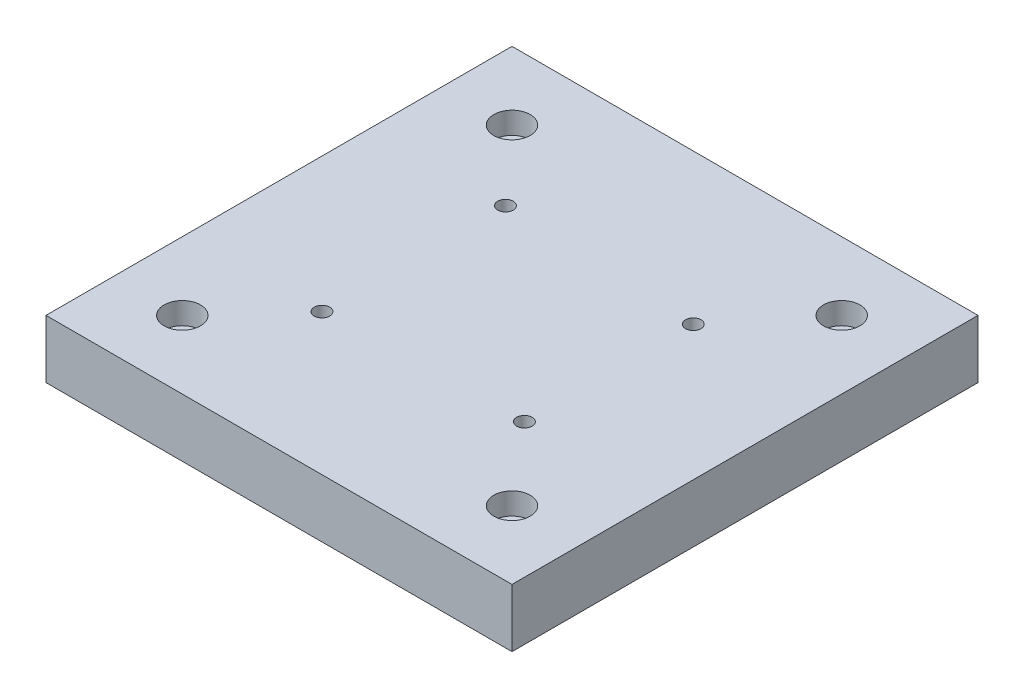
ISO-10303-21;
HEADER;
FILE_DESCRIPTION(('STEP AP214'),'2;1');
FILE_NAME('part.step','',(''),(''),'','','');
FILE_SCHEMA(('AUTOMOTIVE_DESIGN { 1 0 10303 214 1 1 1 1 }'));
ENDSEC;
DATA;
#1=APPLICATION_CONTEXT('core data for automotive mechanical design processes');
#2=APPLICATION_PROTOCOL_DEFINITION('international standard','automotive_design',2000,#1);
#3=PRODUCT_CONTEXT('',#1,'mechanical');
#4=PRODUCT('Part','Part','',(#3));
#5=PRODUCT_RELATED_PRODUCT_CATEGORY('part','',(#4));
#6=PRODUCT_DEFINITION_FORMATION('','',#4);
#7=PRODUCT_DEFINITION_CONTEXT('part definition',#1,'design');
#8=PRODUCT_DEFINITION('design','',#6,#7);
#9=PRODUCT_DEFINITION_SHAPE('','',#8);
#10=(LENGTH_UNIT() NAMED_UNIT(*) SI_UNIT(.MILLI.,.METRE.));
#11=(NAMED_UNIT(*) PLANE_ANGLE_UNIT() SI_UNIT($,.RADIAN.));
#12=(NAMED_UNIT(*) SI_UNIT($,.STERADIAN.) SOLID_ANGLE_UNIT());
#13=UNCERTAINTY_MEASURE_WITH_UNIT(LENGTH_MEASURE(1.E-05),#10,'distance_accuracy_value','');
#14=(GEOMETRIC_REPRESENTATION_CONTEXT(3) GLOBAL_UNCERTAINTY_ASSIGNED_CONTEXT((#13)) GLOBAL_UNIT_ASSIGNED_CONTEXT((#10,
#11,#12)) REPRESENTATION_CONTEXT('',''));
#15=CARTESIAN_POINT('',(0.,0.,0.));
#16=DIRECTION('',(0.,0.,1.));
#17=DIRECTION('',(1.,0.,0.));
#18=AXIS2_PLACEMENT_3D('',#15,#16,#17);
#19=CARTESIAN_POINT('',(0.,25.4,0.));
#20=DIRECTION('',(1.,0.,0.));
#21=DIRECTION('',(0.,0.,-1.));
#22=AXIS2_PLACEMENT_3D('',#19,#20,#21);
#23=PLANE('',#22);
#24=DIRECTION('',(0.,0.,1.));
#25=VECTOR('',#24,1.);
#26=CARTESIAN_POINT('',(0.,0.,0.));
#27=LINE('',#26,#25);
#28=CARTESIAN_POINT('',(0.,0.,-203.2));
#29=VERTEX_POINT('',#28);
#30=CARTESIAN_POINT('',(0.,0.,0.));
#31=VERTEX_POINT('',#30);
#32=EDGE_CURVE('E109',#29,#31,#27,.T.);
#33=ORIENTED_EDGE('',*,*,#32,.T.);
#34=DIRECTION('',(0.,-1.,0.));
#35=VECTOR('',#34,1.);
#36=CARTESIAN_POINT('',(0.,25.4,0.));
#37=LINE('',#36,#35);
#38=CARTESIAN_POINT('',(0.,25.4,0.));
#39=VERTEX_POINT('',#38);
#40=EDGE_CURVE('E11',#39,#31,#37,.T.);
#41=ORIENTED_EDGE('',*,*,#40,.F.);
#42=DIRECTION('',(0.,0.,1.));
#43=VECTOR('',#42,1.);
#44=CARTESIAN_POINT('',(0.,25.4,0.));
#45=LINE('',#44,#43);
#46=CARTESIAN_POINT('',(0.,25.4,-203.2));
#47=VERTEX_POINT('',#46);
#48=EDGE_CURVE('E93',#47,#39,#45,.T.);
#49=ORIENTED_EDGE('',*,*,#48,.F.);
#50=DIRECTION('',(0.,-1.,0.));
#51=VECTOR('',#50,1.);
#52=CARTESIAN_POINT('',(0.,25.4,-203.2));
#53=LINE('',#52,#51);
#54=EDGE_CURVE('E105',#47,#29,#53,.T.);
#55=ORIENTED_EDGE('',*,*,#54,.T.);
#56=EDGE_LOOP('',(#33,#41,#49,#55));
#57=FACE_BOUND('',#56,.T.);
#58=ADVANCED_FACE('F41',(#57),#23,.F.);
#59=CARTESIAN_POINT('',(0.,25.4,0.));
#60=DIRECTION('',(0.,0.,-1.));
#61=DIRECTION('',(-1.,0.,0.));
#62=AXIS2_PLACEMENT_3D('',#59,#60,#61);
#63=PLANE('',#62);
#64=DIRECTION('',(1.,0.,0.));
#65=VECTOR('',#64,1.);
#66=CARTESIAN_POINT('',(0.,0.,0.));
#67=LINE('',#66,#65);
#68=CARTESIAN_POINT('',(203.2,0.,0.));
#69=VERTEX_POINT('',#68);
#70=EDGE_CURVE('E98',#31,#69,#67,.T.);
#71=ORIENTED_EDGE('',*,*,#70,.T.);
#72=DIRECTION('',(0.,-1.,0.));
#73=VECTOR('',#72,1.);
#74=CARTESIAN_POINT('',(203.2,25.4,0.));
#75=LINE('',#74,#73);
#76=CARTESIAN_POINT('',(203.2,25.4,0.));
#77=VERTEX_POINT('',#76);
#78=EDGE_CURVE('E50',#77,#69,#75,.T.);
#79=ORIENTED_EDGE('',*,*,#78,.F.);
#80=DIRECTION('',(1.,0.,0.));
#81=VECTOR('',#80,1.);
#82=CARTESIAN_POINT('',(0.,25.4,0.));
#83=LINE('',#82,#81);
#84=EDGE_CURVE('E88',#39,#77,#83,.T.);
#85=ORIENTED_EDGE('',*,*,#84,.F.);
#86=ORIENTED_EDGE('',*,*,#40,.T.);
#87=EDGE_LOOP('',(#71,#79,#85,#86));
#88=FACE_BOUND('',#87,.T.);
#89=ADVANCED_FACE('F97',(#88),#63,.F.);
#90=CARTESIAN_POINT('',(203.2,25.4,0.));
#91=DIRECTION('',(-1.,0.,0.));
#92=DIRECTION('',(0.,0.,1.));
#93=AXIS2_PLACEMENT_3D('',#90,#91,#92);
#94=PLANE('',#93);
#95=DIRECTION('',(0.,0.,-1.));
#96=VECTOR('',#95,1.);
#97=CARTESIAN_POINT('',(203.2,0.,0.));
#98=LINE('',#97,#96);
#99=CARTESIAN_POINT('',(203.2,0.,-203.2));
#100=VERTEX_POINT('',#99);
#101=EDGE_CURVE('E75',#69,#100,#98,.T.);
#102=ORIENTED_EDGE('',*,*,#101,.T.);
#103=DIRECTION('',(0.,-1.,0.));
#104=VECTOR('',#103,1.);
#105=CARTESIAN_POINT('',(203.2,25.4,-203.2));
#106=LINE('',#105,#104);
#107=CARTESIAN_POINT('',(203.2,25.4,-203.2));
#108=VERTEX_POINT('',#107);
#109=EDGE_CURVE('E100',#108,#100,#106,.T.);
#110=ORIENTED_EDGE('',*,*,#109,.F.);
#111=DIRECTION('',(0.,0.,-1.));
#112=VECTOR('',#111,1.);
#113=CARTESIAN_POINT('',(203.2,25.4,0.));
#114=LINE('',#113,#112);
#115=EDGE_CURVE('E91',#77,#108,#114,.T.);
#116=ORIENTED_EDGE('',*,*,#115,.F.);
#117=ORIENTED_EDGE('',*,*,#78,.T.);
#118=EDGE_LOOP('',(#102,#110,#116,#117));
#119=FACE_BOUND('',#118,.T.);
#120=ADVANCED_FACE('F101',(#119),#94,.F.);
#121=CARTESIAN_POINT('',(0.,25.4,-203.2));
#122=DIRECTION('',(0.,0.,1.));
#123=DIRECTION('',(1.,0.,0.));
#124=AXIS2_PLACEMENT_3D('',#121,#122,#123);
#125=PLANE('',#124);
#126=DIRECTION('',(-1.,0.,0.));
#127=VECTOR('',#126,1.);
#128=CARTESIAN_POINT('',(0.,0.,-203.2));
#129=LINE('',#128,#127);
#130=EDGE_CURVE('E81',#100,#29,#129,.T.);
#131=ORIENTED_EDGE('',*,*,#130,.T.);
#132=ORIENTED_EDGE('',*,*,#54,.F.);
#133=DIRECTION('',(-1.,0.,0.));
#134=VECTOR('',#133,1.);
#135=CARTESIAN_POINT('',(0.,25.4,-203.2));
#136=LINE('',#135,#134);
#137=EDGE_CURVE('E58',#108,#47,#136,.T.);
#138=ORIENTED_EDGE('',*,*,#137,.F.);
#139=ORIENTED_EDGE('',*,*,#109,.T.);
#140=EDGE_LOOP('',(#131,#132,#138,#139));
#141=FACE_BOUND('',#140,.T.);
#142=ADVANCED_FACE('F123',(#141),#125,.F.);
#143=CARTESIAN_POINT('',(0.,25.4,0.));
#144=DIRECTION('',(0.,-1.,0.));
#145=DIRECTION('',(0.,0.,-1.));
#146=AXIS2_PLACEMENT_3D('',#143,#144,#145);
#147=PLANE('',#146);
#148=CARTESIAN_POINT('',(29.718,25.4,-173.482));
#149=DIRECTION('',(0.,1.,0.));
#150=DIRECTION('',(0.,0.,1.));
#151=AXIS2_PLACEMENT_3D('',#148,#149,#150);
#152=CIRCLE('',#151,7.9375);
#153=CARTESIAN_POINT('',(29.718,25.4,-165.5445));
#154=VERTEX_POINT('',#153);
#155=EDGE_CURVE('E253',#154,#154,#152,.T.);
#156=ORIENTED_EDGE('',*,*,#155,.F.);
#157=EDGE_LOOP('',(#156));
#158=FACE_BOUND('',#157,.T.);
#159=CARTESIAN_POINT('',(29.718,25.4,-29.718));
#160=DIRECTION('',(0.,1.,0.));
#161=DIRECTION('',(0.,0.,1.));
#162=AXIS2_PLACEMENT_3D('',#159,#160,#161);
#163=CIRCLE('',#162,7.9375);
#164=CARTESIAN_POINT('',(29.718,25.4,-21.7805));
#165=VERTEX_POINT('',#164);
#166=EDGE_CURVE('E237',#165,#165,#163,.T.);
#167=ORIENTED_EDGE('',*,*,#166,.F.);
#168=EDGE_LOOP('',(#167));
#169=FACE_BOUND('',#168,.T.);
#170=CARTESIAN_POINT('',(173.482,25.4,-29.718));
#171=DIRECTION('',(0.,1.,0.));
#172=DIRECTION('',(0.,0.,1.));
#173=AXIS2_PLACEMENT_3D('',#170,#171,#172);
#174=CIRCLE('',#173,7.93749999999999);
#175=CARTESIAN_POINT('',(173.482,25.4,-21.7805));
#176=VERTEX_POINT('',#175);
#177=EDGE_CURVE('E221',#176,#176,#174,.T.);
#178=ORIENTED_EDGE('',*,*,#177,.F.);
#179=EDGE_LOOP('',(#178));
#180=FACE_BOUND('',#179,.T.);
#181=CARTESIAN_POINT('',(173.482,25.4,-173.482));
#182=DIRECTION('',(0.,1.,0.));
#183=DIRECTION('',(0.,0.,1.));
#184=AXIS2_PLACEMENT_3D('',#181,#182,#183);
#185=CIRCLE('',#184,7.93749999999999);
#186=CARTESIAN_POINT('',(173.482,25.4,-165.5445));
#187=VERTEX_POINT('',#186);
#188=EDGE_CURVE('E205',#187,#187,#185,.T.);
#189=ORIENTED_EDGE('',*,*,#188,.F.);
#190=EDGE_LOOP('',(#189));
#191=FACE_BOUND('',#190,.T.);
#192=CARTESIAN_POINT('',(144.4625,25.4,-64.135));
#193=DIRECTION('',(0.,-1.,0.));
#194=DIRECTION('',(0.,0.,-1.));
#195=AXIS2_PLACEMENT_3D('',#192,#193,#194);
#196=CIRCLE('',#195,3.3782);
#197=CARTESIAN_POINT('',(144.4625,25.4,-67.5132));
#198=VERTEX_POINT('',#197);
#199=EDGE_CURVE('E177',#198,#198,#196,.T.);
#200=ORIENTED_EDGE('',*,*,#199,.T.);
#201=EDGE_LOOP('',(#200));
#202=FACE_BOUND('',#201,.T.);
#203=CARTESIAN_POINT('',(58.7375,25.4,-61.595));
#204=DIRECTION('',(0.,-1.,0.));
#205=DIRECTION('',(0.,0.,-1.));
#206=AXIS2_PLACEMENT_3D('',#203,#204,#205);
#207=CIRCLE('',#206,3.37819999999999);
#208=CARTESIAN_POINT('',(58.7375,25.4,-64.9732));
#209=VERTEX_POINT('',#208);
#210=EDGE_CURVE('E161',#209,#209,#207,.T.);
#211=ORIENTED_EDGE('',*,*,#210,.T.);
#212=EDGE_LOOP('',(#211));
#213=FACE_BOUND('',#212,.T.);
#214=CARTESIAN_POINT('',(58.7375,25.4,-141.605));
#215=DIRECTION('',(0.,-1.,0.));
#216=DIRECTION('',(0.,0.,-1.));
#217=AXIS2_PLACEMENT_3D('',#214,#215,#216);
#218=CIRCLE('',#217,3.37819999999999);
#219=CARTESIAN_POINT('',(58.7375,25.4,-144.9832));
#220=VERTEX_POINT('',#219);
#221=EDGE_CURVE('E145',#220,#220,#218,.T.);
#222=ORIENTED_EDGE('',*,*,#221,.T.);
#223=EDGE_LOOP('',(#222));
#224=FACE_BOUND('',#223,.T.);
#225=CARTESIAN_POINT('',(144.4625,25.4,-137.795));
#226=DIRECTION('',(0.,-1.,0.));
#227=DIRECTION('',(0.,0.,-1.));
#228=AXIS2_PLACEMENT_3D('',#225,#226,#227);
#229=CIRCLE('',#228,3.3782);
#230=CARTESIAN_POINT('',(144.4625,25.4,-141.1732));
#231=VERTEX_POINT('',#230);
#232=EDGE_CURVE('E113',#231,#231,#229,.T.);
#233=ORIENTED_EDGE('',*,*,#232,.T.);
#234=EDGE_LOOP('',(#233));
#235=FACE_BOUND('',#234,.T.);
#236=ORIENTED_EDGE('',*,*,#48,.T.);
#237=ORIENTED_EDGE('',*,*,#84,.T.);
#238=ORIENTED_EDGE('',*,*,#115,.T.);
#239=ORIENTED_EDGE('',*,*,#137,.T.);
#240=EDGE_LOOP('',(#236,#237,#238,#239));
#241=FACE_BOUND('',#240,.T.);
#242=ADVANCED_FACE('F89',(#158,#169,#180,#191,#202,#213,#224,#235,#241),#147,.F.);
#243=CARTESIAN_POINT('',(0.,0.,0.));
#244=DIRECTION('',(0.,-1.,0.));
#245=DIRECTION('',(0.,0.,-1.));
#246=AXIS2_PLACEMENT_3D('',#243,#244,#245);
#247=PLANE('',#246);
#248=CARTESIAN_POINT('',(29.718,0.,-173.482));
#249=DIRECTION('',(0.,1.,0.));
#250=DIRECTION('',(0.,0.,1.));
#251=AXIS2_PLACEMENT_3D('',#248,#249,#250);
#252=CIRCLE('',#251,5.04189999999999);
#253=CARTESIAN_POINT('',(29.718,0.,-168.4401));
#254=VERTEX_POINT('',#253);
#255=EDGE_CURVE('E241',#254,#254,#252,.T.);
#256=ORIENTED_EDGE('',*,*,#255,.T.);
#257=EDGE_LOOP('',(#256));
#258=FACE_BOUND('',#257,.T.);
#259=CARTESIAN_POINT('',(29.718,0.,-29.718));
#260=DIRECTION('',(0.,1.,0.));
#261=DIRECTION('',(0.,0.,1.));
#262=AXIS2_PLACEMENT_3D('',#259,#260,#261);
#263=CIRCLE('',#262,5.04189999999999);
#264=CARTESIAN_POINT('',(29.718,0.,-24.6761));
#265=VERTEX_POINT('',#264);
#266=EDGE_CURVE('E225',#265,#265,#263,.T.);
#267=ORIENTED_EDGE('',*,*,#266,.T.);
#268=EDGE_LOOP('',(#267));
#269=FACE_BOUND('',#268,.T.);
#270=CARTESIAN_POINT('',(173.482,0.,-29.718));
#271=DIRECTION('',(0.,1.,0.));
#272=DIRECTION('',(0.,0.,1.));
#273=AXIS2_PLACEMENT_3D('',#270,#271,#272);
#274=CIRCLE('',#273,5.04189999999999);
#275=CARTESIAN_POINT('',(173.482,0.,-24.6761));
#276=VERTEX_POINT('',#275);
#277=EDGE_CURVE('E209',#276,#276,#274,.T.);
#278=ORIENTED_EDGE('',*,*,#277,.T.);
#279=EDGE_LOOP('',(#278));
#280=FACE_BOUND('',#279,.T.);
#281=CARTESIAN_POINT('',(173.482,0.,-173.482));
#282=DIRECTION('',(0.,1.,0.));
#283=DIRECTION('',(0.,0.,1.));
#284=AXIS2_PLACEMENT_3D('',#281,#282,#283);
#285=CIRCLE('',#284,5.04189999999999);
#286=CARTESIAN_POINT('',(173.482,0.,-168.4401));
#287=VERTEX_POINT('',#286);
#288=EDGE_CURVE('E193',#287,#287,#285,.T.);
#289=ORIENTED_EDGE('',*,*,#288,.T.);
#290=EDGE_LOOP('',(#289));
#291=FACE_BOUND('',#290,.T.);
#292=CARTESIAN_POINT('',(144.4625,0.,-64.135));
#293=DIRECTION('',(0.,-1.,0.));
#294=DIRECTION('',(0.,0.,-1.));
#295=AXIS2_PLACEMENT_3D('',#292,#293,#294);
#296=CIRCLE('',#295,5.55624999999998);
#297=CARTESIAN_POINT('',(144.4625,0.,-69.69125));
#298=VERTEX_POINT('',#297);
#299=EDGE_CURVE('E189',#298,#298,#296,.T.);
#300=ORIENTED_EDGE('',*,*,#299,.F.);
#301=EDGE_LOOP('',(#300));
#302=FACE_BOUND('',#301,.T.);
#303=CARTESIAN_POINT('',(58.7375,0.,-61.595));
#304=DIRECTION('',(0.,-1.,0.));
#305=DIRECTION('',(0.,0.,-1.));
#306=AXIS2_PLACEMENT_3D('',#303,#304,#305);
#307=CIRCLE('',#306,5.55624999999999);
#308=CARTESIAN_POINT('',(58.7375,0.,-67.15125));
#309=VERTEX_POINT('',#308);
#310=EDGE_CURVE('E173',#309,#309,#307,.T.);
#311=ORIENTED_EDGE('',*,*,#310,.F.);
#312=EDGE_LOOP('',(#311));
#313=FACE_BOUND('',#312,.T.);
#314=CARTESIAN_POINT('',(58.7375,0.,-141.605));
#315=DIRECTION('',(0.,-1.,0.));
#316=DIRECTION('',(0.,0.,-1.));
#317=AXIS2_PLACEMENT_3D('',#314,#315,#316);
#318=CIRCLE('',#317,5.55625);
#319=CARTESIAN_POINT('',(58.7375,0.,-147.16125));
#320=VERTEX_POINT('',#319);
#321=EDGE_CURVE('E157',#320,#320,#318,.T.);
#322=ORIENTED_EDGE('',*,*,#321,.F.);
#323=EDGE_LOOP('',(#322));
#324=FACE_BOUND('',#323,.T.);
#325=CARTESIAN_POINT('',(144.4625,0.,-137.795));
#326=DIRECTION('',(0.,-1.,0.));
#327=DIRECTION('',(0.,0.,-1.));
#328=AXIS2_PLACEMENT_3D('',#325,#326,#327);
#329=CIRCLE('',#328,5.55624999999998);
#330=CARTESIAN_POINT('',(144.4625,0.,-143.35125));
#331=VERTEX_POINT('',#330);
#332=EDGE_CURVE('E141',#331,#331,#329,.T.);
#333=ORIENTED_EDGE('',*,*,#332,.F.);
#334=EDGE_LOOP('',(#333));
#335=FACE_BOUND('',#334,.T.);
#336=ORIENTED_EDGE('',*,*,#32,.F.);
#337=ORIENTED_EDGE('',*,*,#130,.F.);
#338=ORIENTED_EDGE('',*,*,#101,.F.);
#339=ORIENTED_EDGE('',*,*,#70,.F.);
#340=EDGE_LOOP('',(#336,#337,#338,#339));
#341=FACE_BOUND('',#340,.T.);
#342=ADVANCED_FACE('F126',(#258,#269,#280,#291,#302,#313,#324,#335,#341),#247,.T.);
#343=CARTESIAN_POINT('',(144.4625,0.,-137.795));
#344=DIRECTION('',(0.,-1.,0.));
#345=DIRECTION('',(0.,0.,-1.));
#346=AXIS2_PLACEMENT_3D('',#343,#344,#345);
#347=CYLINDRICAL_SURFACE('',#346,3.3782);
#348=ORIENTED_EDGE('',*,*,#232,.F.);
#349=EDGE_LOOP('',(#348));
#350=FACE_BOUND('',#349,.T.);
#351=CARTESIAN_POINT('',(144.4625,18.3500014,-137.795));
#352=DIRECTION('',(0.,-1.,0.));
#353=DIRECTION('',(0.,0.,-1.));
#354=AXIS2_PLACEMENT_3D('',#351,#352,#353);
#355=CIRCLE('',#354,3.3782);
#356=CARTESIAN_POINT('',(144.4625,18.3500014,-141.1732));
#357=VERTEX_POINT('',#356);
#358=EDGE_CURVE('E133',#357,#357,#355,.T.);
#359=ORIENTED_EDGE('',*,*,#358,.T.);
#360=EDGE_LOOP('',(#359));
#361=FACE_BOUND('',#360,.T.);
#362=ADVANCED_FACE('F277',(#350,#361),#347,.F.);
#363=CARTESIAN_POINT('',(147.8407,18.3500014,-137.795));
#364=DIRECTION('',(0.,1.,0.));
#365=DIRECTION('',(0.,0.,1.));
#366=AXIS2_PLACEMENT_3D('',#363,#364,#365);
#367=PLANE('',#366);
#368=ORIENTED_EDGE('',*,*,#358,.F.);
#369=EDGE_LOOP('',(#368));
#370=FACE_BOUND('',#369,.T.);
#371=CARTESIAN_POINT('',(144.4625,18.3500014,-137.795));
#372=DIRECTION('',(0.,-1.,0.));
#373=DIRECTION('',(0.,0.,-1.));
#374=AXIS2_PLACEMENT_3D('',#371,#372,#373);
#375=CIRCLE('',#374,5.55624999999998);
#376=CARTESIAN_POINT('',(144.4625,18.3500014,-143.35125));
#377=VERTEX_POINT('',#376);
#378=EDGE_CURVE('E137',#377,#377,#375,.T.);
#379=ORIENTED_EDGE('',*,*,#378,.T.);
#380=EDGE_LOOP('',(#379));
#381=FACE_BOUND('',#380,.T.);
#382=ADVANCED_FACE('F280',(#370,#381),#367,.F.);
#383=CARTESIAN_POINT('',(144.4625,0.,-137.795));
#384=DIRECTION('',(0.,-1.,0.));
#385=DIRECTION('',(0.,0.,-1.));
#386=AXIS2_PLACEMENT_3D('',#383,#384,#385);
#387=CYLINDRICAL_SURFACE('',#386,5.55624999999998);
#388=ORIENTED_EDGE('',*,*,#378,.F.);
#389=EDGE_LOOP('',(#388));
#390=FACE_BOUND('',#389,.T.);
#391=ORIENTED_EDGE('',*,*,#332,.T.);
#392=EDGE_LOOP('',(#391));
#393=FACE_BOUND('',#392,.T.);
#394=ADVANCED_FACE('F286',(#390,#393),#387,.F.);
#395=CARTESIAN_POINT('',(58.7375,0.,-141.605));
#396=DIRECTION('',(0.,-1.,0.));
#397=DIRECTION('',(0.,0.,-1.));
#398=AXIS2_PLACEMENT_3D('',#395,#396,#397);
#399=CYLINDRICAL_SURFACE('',#398,3.37819999999999);
#400=ORIENTED_EDGE('',*,*,#221,.F.);
#401=EDGE_LOOP('',(#400));
#402=FACE_BOUND('',#401,.T.);
#403=CARTESIAN_POINT('',(58.7375,18.3500014,-141.605));
#404=DIRECTION('',(0.,-1.,0.));
#405=DIRECTION('',(0.,0.,-1.));
#406=AXIS2_PLACEMENT_3D('',#403,#404,#405);
#407=CIRCLE('',#406,3.3782);
#408=CARTESIAN_POINT('',(58.7375,18.3500014,-144.9832));
#409=VERTEX_POINT('',#408);
#410=EDGE_CURVE('E149',#409,#409,#407,.T.);
#411=ORIENTED_EDGE('',*,*,#410,.T.);
#412=EDGE_LOOP('',(#411));
#413=FACE_BOUND('',#412,.T.);
#414=ADVANCED_FACE('F292',(#402,#413),#399,.F.);
#415=CARTESIAN_POINT('',(62.1157,18.3500014,-141.605));
#416=DIRECTION('',(0.,1.,0.));
#417=DIRECTION('',(0.,0.,1.));
#418=AXIS2_PLACEMENT_3D('',#415,#416,#417);
#419=PLANE('',#418);
#420=ORIENTED_EDGE('',*,*,#410,.F.);
#421=EDGE_LOOP('',(#420));
#422=FACE_BOUND('',#421,.T.);
#423=CARTESIAN_POINT('',(58.7375,18.3500014,-141.605));
#424=DIRECTION('',(0.,-1.,0.));
#425=DIRECTION('',(0.,0.,-1.));
#426=AXIS2_PLACEMENT_3D('',#423,#424,#425);
#427=CIRCLE('',#426,5.55625);
#428=CARTESIAN_POINT('',(58.7375,18.3500014,-147.16125));
#429=VERTEX_POINT('',#428);
#430=EDGE_CURVE('E153',#429,#429,#427,.T.);
#431=ORIENTED_EDGE('',*,*,#430,.T.);
#432=EDGE_LOOP('',(#431));
#433=FACE_BOUND('',#432,.T.);
#434=ADVANCED_FACE('F482',(#422,#433),#419,.F.);
#435=CARTESIAN_POINT('',(58.7375,0.,-141.605));
#436=DIRECTION('',(0.,-1.,0.));
#437=DIRECTION('',(0.,0.,-1.));
#438=AXIS2_PLACEMENT_3D('',#435,#436,#437);
#439=CYLINDRICAL_SURFACE('',#438,5.55625);
#440=ORIENTED_EDGE('',*,*,#430,.F.);
#441=EDGE_LOOP('',(#440));
#442=FACE_BOUND('',#441,.T.);
#443=ORIENTED_EDGE('',*,*,#321,.T.);
#444=EDGE_LOOP('',(#443));
#445=FACE_BOUND('',#444,.T.);
#446=ADVANCED_FACE('F478',(#442,#445),#439,.F.);
#447=CARTESIAN_POINT('',(58.7375,0.,-61.595));
#448=DIRECTION('',(0.,-1.,0.));
#449=DIRECTION('',(0.,0.,-1.));
#450=AXIS2_PLACEMENT_3D('',#447,#448,#449);
#451=CYLINDRICAL_SURFACE('',#450,3.37819999999999);
#452=ORIENTED_EDGE('',*,*,#210,.F.);
#453=EDGE_LOOP('',(#452));
#454=FACE_BOUND('',#453,.T.);
#455=CARTESIAN_POINT('',(58.7375,18.3500014,-61.595));
#456=DIRECTION('',(0.,-1.,0.));
#457=DIRECTION('',(0.,0.,-1.));
#458=AXIS2_PLACEMENT_3D('',#455,#456,#457);
#459=CIRCLE('',#458,3.3782);
#460=CARTESIAN_POINT('',(58.7375,18.3500014,-64.9732));
#461=VERTEX_POINT('',#460);
#462=EDGE_CURVE('E165',#461,#461,#459,.T.);
#463=ORIENTED_EDGE('',*,*,#462,.T.);
#464=EDGE_LOOP('',(#463));
#465=FACE_BOUND('',#464,.T.);
#466=ADVANCED_FACE('F474',(#454,#465),#451,.F.);
#467=CARTESIAN_POINT('',(62.1157,18.3500014,-61.595));
#468=DIRECTION('',(0.,1.,0.));
#469=DIRECTION('',(0.,0.,1.));
#470=AXIS2_PLACEMENT_3D('',#467,#468,#469);
#471=PLANE('',#470);
#472=ORIENTED_EDGE('',*,*,#462,.F.);
#473=EDGE_LOOP('',(#472));
#474=FACE_BOUND('',#473,.T.);
#475=CARTESIAN_POINT('',(58.7375,18.3500014,-61.595));
#476=DIRECTION('',(0.,-1.,0.));
#477=DIRECTION('',(0.,0.,-1.));
#478=AXIS2_PLACEMENT_3D('',#475,#476,#477);
#479=CIRCLE('',#478,5.55624999999999);
#480=CARTESIAN_POINT('',(58.7375,18.3500014,-67.15125));
#481=VERTEX_POINT('',#480);
#482=EDGE_CURVE('E169',#481,#481,#479,.T.);
#483=ORIENTED_EDGE('',*,*,#482,.T.);
#484=EDGE_LOOP('',(#483));
#485=FACE_BOUND('',#484,.T.);
#486=ADVANCED_FACE('F470',(#474,#485),#471,.F.);
#487=CARTESIAN_POINT('',(58.7375,0.,-61.595));
#488=DIRECTION('',(0.,-1.,0.));
#489=DIRECTION('',(0.,0.,-1.));
#490=AXIS2_PLACEMENT_3D('',#487,#488,#489);
#491=CYLINDRICAL_SURFACE('',#490,5.55624999999999);
#492=ORIENTED_EDGE('',*,*,#482,.F.);
#493=EDGE_LOOP('',(#492));
#494=FACE_BOUND('',#493,.T.);
#495=ORIENTED_EDGE('',*,*,#310,.T.);
#496=EDGE_LOOP('',(#495));
#497=FACE_BOUND('',#496,.T.);
#498=ADVANCED_FACE('F466',(#494,#497),#491,.F.);
#499=CARTESIAN_POINT('',(144.4625,0.,-64.135));
#500=DIRECTION('',(0.,-1.,0.));
#501=DIRECTION('',(0.,0.,-1.));
#502=AXIS2_PLACEMENT_3D('',#499,#500,#501);
#503=CYLINDRICAL_SURFACE('',#502,3.3782);
#504=ORIENTED_EDGE('',*,*,#199,.F.);
#505=EDGE_LOOP('',(#504));
#506=FACE_BOUND('',#505,.T.);
#507=CARTESIAN_POINT('',(144.4625,18.3500014,-64.135));
#508=DIRECTION('',(0.,-1.,0.));
#509=DIRECTION('',(0.,0.,-1.));
#510=AXIS2_PLACEMENT_3D('',#507,#508,#509);
#511=CIRCLE('',#510,3.3782);
#512=CARTESIAN_POINT('',(144.4625,18.3500014,-67.5132));
#513=VERTEX_POINT('',#512);
#514=EDGE_CURVE('E181',#513,#513,#511,.T.);
#515=ORIENTED_EDGE('',*,*,#514,.T.);
#516=EDGE_LOOP('',(#515));
#517=FACE_BOUND('',#516,.T.);
#518=ADVANCED_FACE('F462',(#506,#517),#503,.F.);
#519=CARTESIAN_POINT('',(147.8407,18.3500014,-64.135));
#520=DIRECTION('',(0.,1.,0.));
#521=DIRECTION('',(0.,0.,1.));
#522=AXIS2_PLACEMENT_3D('',#519,#520,#521);
#523=PLANE('',#522);
#524=ORIENTED_EDGE('',*,*,#514,.F.);
#525=EDGE_LOOP('',(#524));
#526=FACE_BOUND('',#525,.T.);
#527=CARTESIAN_POINT('',(144.4625,18.3500014,-64.135));
#528=DIRECTION('',(0.,-1.,0.));
#529=DIRECTION('',(0.,0.,-1.));
#530=AXIS2_PLACEMENT_3D('',#527,#528,#529);
#531=CIRCLE('',#530,5.55624999999998);
#532=CARTESIAN_POINT('',(144.4625,18.3500014,-69.69125));
#533=VERTEX_POINT('',#532);
#534=EDGE_CURVE('E185',#533,#533,#531,.T.);
#535=ORIENTED_EDGE('',*,*,#534,.T.);
#536=EDGE_LOOP('',(#535));
#537=FACE_BOUND('',#536,.T.);
#538=ADVANCED_FACE('F458',(#526,#537),#523,.F.);
#539=CARTESIAN_POINT('',(144.4625,0.,-64.135));
#540=DIRECTION('',(0.,-1.,0.));
#541=DIRECTION('',(0.,0.,-1.));
#542=AXIS2_PLACEMENT_3D('',#539,#540,#541);
#543=CYLINDRICAL_SURFACE('',#542,5.55624999999998);
#544=ORIENTED_EDGE('',*,*,#534,.F.);
#545=EDGE_LOOP('',(#544));
#546=FACE_BOUND('',#545,.T.);
#547=ORIENTED_EDGE('',*,*,#299,.T.);
#548=EDGE_LOOP('',(#547));
#549=FACE_BOUND('',#548,.T.);
#550=ADVANCED_FACE('F327',(#546,#549),#543,.F.);
#551=CARTESIAN_POINT('',(173.482,25.4,-173.482));
#552=DIRECTION('',(0.,1.,0.));
#553=DIRECTION('',(0.,0.,1.));
#554=AXIS2_PLACEMENT_3D('',#551,#552,#553);
#555=CYLINDRICAL_SURFACE('',#554,5.04189999999999);
#556=ORIENTED_EDGE('',*,*,#288,.F.);
#557=EDGE_LOOP('',(#556));
#558=FACE_BOUND('',#557,.T.);
#559=CARTESIAN_POINT('',(173.482,15.875,-173.482));
#560=DIRECTION('',(0.,1.,0.));
#561=DIRECTION('',(0.,0.,1.));
#562=AXIS2_PLACEMENT_3D('',#559,#560,#561);
#563=CIRCLE('',#562,5.04189999999999);
#564=CARTESIAN_POINT('',(173.482,15.875,-168.4401));
#565=VERTEX_POINT('',#564);
#566=EDGE_CURVE('E197',#565,#565,#563,.T.);
#567=ORIENTED_EDGE('',*,*,#566,.T.);
#568=EDGE_LOOP('',(#567));
#569=FACE_BOUND('',#568,.T.);
#570=ADVANCED_FACE('F337',(#558,#569),#555,.F.);
#571=CARTESIAN_POINT('',(178.5239,15.875,-173.482));
#572=DIRECTION('',(0.,-1.,0.));
#573=DIRECTION('',(0.,0.,-1.));
#574=AXIS2_PLACEMENT_3D('',#571,#572,#573);
#575=PLANE('',#574);
#576=ORIENTED_EDGE('',*,*,#566,.F.);
#577=EDGE_LOOP('',(#576));
#578=FACE_BOUND('',#577,.T.);
#579=CARTESIAN_POINT('',(173.482,15.875,-173.482));
#580=DIRECTION('',(0.,1.,0.));
#581=DIRECTION('',(0.,0.,1.));
#582=AXIS2_PLACEMENT_3D('',#579,#580,#581);
#583=CIRCLE('',#582,7.93749999999999);
#584=CARTESIAN_POINT('',(173.482,15.875,-165.5445));
#585=VERTEX_POINT('',#584);
#586=EDGE_CURVE('E201',#585,#585,#583,.T.);
#587=ORIENTED_EDGE('',*,*,#586,.T.);
#588=EDGE_LOOP('',(#587));
#589=FACE_BOUND('',#588,.T.);
#590=ADVANCED_FACE('F342',(#578,#589),#575,.F.);
#591=CARTESIAN_POINT('',(173.482,25.4,-173.482));
#592=DIRECTION('',(0.,1.,0.));
#593=DIRECTION('',(0.,0.,1.));
#594=AXIS2_PLACEMENT_3D('',#591,#592,#593);
#595=CYLINDRICAL_SURFACE('',#594,7.93749999999999);
#596=ORIENTED_EDGE('',*,*,#586,.F.);
#597=EDGE_LOOP('',(#596));
#598=FACE_BOUND('',#597,.T.);
#599=ORIENTED_EDGE('',*,*,#188,.T.);
#600=EDGE_LOOP('',(#599));
#601=FACE_BOUND('',#600,.T.);
#602=ADVANCED_FACE('F352',(#598,#601),#595,.F.);
#603=CARTESIAN_POINT('',(173.482,25.4,-29.718));
#604=DIRECTION('',(0.,1.,0.));
#605=DIRECTION('',(0.,0.,1.));
#606=AXIS2_PLACEMENT_3D('',#603,#604,#605);
#607=CYLINDRICAL_SURFACE('',#606,5.04189999999999);
#608=ORIENTED_EDGE('',*,*,#277,.F.);
#609=EDGE_LOOP('',(#608));
#610=FACE_BOUND('',#609,.T.);
#611=CARTESIAN_POINT('',(173.482,15.875,-29.718));
#612=DIRECTION('',(0.,1.,0.));
#613=DIRECTION('',(0.,0.,1.));
#614=AXIS2_PLACEMENT_3D('',#611,#612,#613);
#615=CIRCLE('',#614,5.04189999999999);
#616=CARTESIAN_POINT('',(173.482,15.875,-24.6761));
#617=VERTEX_POINT('',#616);
#618=EDGE_CURVE('E213',#617,#617,#615,.T.);
#619=ORIENTED_EDGE('',*,*,#618,.T.);
#620=EDGE_LOOP('',(#619));
#621=FACE_BOUND('',#620,.T.);
#622=ADVANCED_FACE('F362',(#610,#621),#607,.F.);
#623=CARTESIAN_POINT('',(178.5239,15.875,-29.718));
#624=DIRECTION('',(0.,-1.,0.));
#625=DIRECTION('',(0.,0.,-1.));
#626=AXIS2_PLACEMENT_3D('',#623,#624,#625);
#627=PLANE('',#626);
#628=ORIENTED_EDGE('',*,*,#618,.F.);
#629=EDGE_LOOP('',(#628));
#630=FACE_BOUND('',#629,.T.);
#631=CARTESIAN_POINT('',(173.482,15.875,-29.718));
#632=DIRECTION('',(0.,1.,0.));
#633=DIRECTION('',(0.,0.,1.));
#634=AXIS2_PLACEMENT_3D('',#631,#632,#633);
#635=CIRCLE('',#634,7.93749999999999);
#636=CARTESIAN_POINT('',(173.482,15.875,-21.7805));
#637=VERTEX_POINT('',#636);
#638=EDGE_CURVE('E217',#637,#637,#635,.T.);
#639=ORIENTED_EDGE('',*,*,#638,.T.);
#640=EDGE_LOOP('',(#639));
#641=FACE_BOUND('',#640,.T.);
#642=ADVANCED_FACE('F372',(#630,#641),#627,.F.);
#643=CARTESIAN_POINT('',(173.482,25.4,-29.718));
#644=DIRECTION('',(0.,1.,0.));
#645=DIRECTION('',(0.,0.,1.));
#646=AXIS2_PLACEMENT_3D('',#643,#644,#645);
#647=CYLINDRICAL_SURFACE('',#646,7.93749999999999);
#648=ORIENTED_EDGE('',*,*,#638,.F.);
#649=EDGE_LOOP('',(#648));
#650=FACE_BOUND('',#649,.T.);
#651=ORIENTED_EDGE('',*,*,#177,.T.);
#652=EDGE_LOOP('',(#651));
#653=FACE_BOUND('',#652,.T.);
#654=ADVANCED_FACE('F382',(#650,#653),#647,.F.);
#655=CARTESIAN_POINT('',(29.718,25.4,-29.718));
#656=DIRECTION('',(0.,1.,0.));
#657=DIRECTION('',(0.,0.,1.));
#658=AXIS2_PLACEMENT_3D('',#655,#656,#657);
#659=CYLINDRICAL_SURFACE('',#658,5.0419);
#660=ORIENTED_EDGE('',*,*,#266,.F.);
#661=EDGE_LOOP('',(#660));
#662=FACE_BOUND('',#661,.T.);
#663=CARTESIAN_POINT('',(29.718,15.875,-29.718));
#664=DIRECTION('',(0.,1.,0.));
#665=DIRECTION('',(0.,0.,1.));
#666=AXIS2_PLACEMENT_3D('',#663,#664,#665);
#667=CIRCLE('',#666,5.0419);
#668=CARTESIAN_POINT('',(29.718,15.875,-24.6761));
#669=VERTEX_POINT('',#668);
#670=EDGE_CURVE('E229',#669,#669,#667,.T.);
#671=ORIENTED_EDGE('',*,*,#670,.T.);
#672=EDGE_LOOP('',(#671));
#673=FACE_BOUND('',#672,.T.);
#674=ADVANCED_FACE('F392',(#662,#673),#659,.F.);
#675=CARTESIAN_POINT('',(34.7599,15.875,-29.718));
#676=DIRECTION('',(0.,-1.,0.));
#677=DIRECTION('',(0.,0.,-1.));
#678=AXIS2_PLACEMENT_3D('',#675,#676,#677);
#679=PLANE('',#678);
#680=ORIENTED_EDGE('',*,*,#670,.F.);
#681=EDGE_LOOP('',(#680));
#682=FACE_BOUND('',#681,.T.);
#683=CARTESIAN_POINT('',(29.718,15.875,-29.718));
#684=DIRECTION('',(0.,1.,0.));
#685=DIRECTION('',(0.,0.,1.));
#686=AXIS2_PLACEMENT_3D('',#683,#684,#685);
#687=CIRCLE('',#686,7.9375);
#688=CARTESIAN_POINT('',(29.718,15.875,-21.7805));
#689=VERTEX_POINT('',#688);
#690=EDGE_CURVE('E233',#689,#689,#687,.T.);
#691=ORIENTED_EDGE('',*,*,#690,.T.);
#692=EDGE_LOOP('',(#691));
#693=FACE_BOUND('',#692,.T.);
#694=ADVANCED_FACE('F402',(#682,#693),#679,.F.);
#695=CARTESIAN_POINT('',(29.718,25.4,-29.718));
#696=DIRECTION('',(0.,1.,0.));
#697=DIRECTION('',(0.,0.,1.));
#698=AXIS2_PLACEMENT_3D('',#695,#696,#697);
#699=CYLINDRICAL_SURFACE('',#698,7.9375);
#700=ORIENTED_EDGE('',*,*,#690,.F.);
#701=EDGE_LOOP('',(#700));
#702=FACE_BOUND('',#701,.T.);
#703=ORIENTED_EDGE('',*,*,#166,.T.);
#704=EDGE_LOOP('',(#703));
#705=FACE_BOUND('',#704,.T.);
#706=ADVANCED_FACE('F412',(#702,#705),#699,.F.);
#707=CARTESIAN_POINT('',(29.718,25.4,-173.482));
#708=DIRECTION('',(0.,1.,0.));
#709=DIRECTION('',(0.,0.,1.));
#710=AXIS2_PLACEMENT_3D('',#707,#708,#709);
#711=CYLINDRICAL_SURFACE('',#710,5.0419);
#712=ORIENTED_EDGE('',*,*,#255,.F.);
#713=EDGE_LOOP('',(#712));
#714=FACE_BOUND('',#713,.T.);
#715=CARTESIAN_POINT('',(29.718,15.875,-173.482));
#716=DIRECTION('',(0.,1.,0.));
#717=DIRECTION('',(0.,0.,1.));
#718=AXIS2_PLACEMENT_3D('',#715,#716,#717);
#719=CIRCLE('',#718,5.0419);
#720=CARTESIAN_POINT('',(29.718,15.875,-168.4401));
#721=VERTEX_POINT('',#720);
#722=EDGE_CURVE('E245',#721,#721,#719,.T.);
#723=ORIENTED_EDGE('',*,*,#722,.T.);
#724=EDGE_LOOP('',(#723));
#725=FACE_BOUND('',#724,.T.);
#726=ADVANCED_FACE('F422',(#714,#725),#711,.F.);
#727=CARTESIAN_POINT('',(34.7599,15.875,-173.482));
#728=DIRECTION('',(0.,-1.,0.));
#729=DIRECTION('',(0.,0.,-1.));
#730=AXIS2_PLACEMENT_3D('',#727,#728,#729);
#731=PLANE('',#730);
#732=ORIENTED_EDGE('',*,*,#722,.F.);
#733=EDGE_LOOP('',(#732));
#734=FACE_BOUND('',#733,.T.);
#735=CARTESIAN_POINT('',(29.718,15.875,-173.482));
#736=DIRECTION('',(0.,1.,0.));
#737=DIRECTION('',(0.,0.,1.));
#738=AXIS2_PLACEMENT_3D('',#735,#736,#737);
#739=CIRCLE('',#738,7.9375);
#740=CARTESIAN_POINT('',(29.718,15.875,-165.5445));
#741=VERTEX_POINT('',#740);
#742=EDGE_CURVE('E249',#741,#741,#739,.T.);
#743=ORIENTED_EDGE('',*,*,#742,.T.);
#744=EDGE_LOOP('',(#743));
#745=FACE_BOUND('',#744,.T.);
#746=ADVANCED_FACE('F432',(#734,#745),#731,.F.);
#747=CARTESIAN_POINT('',(29.718,25.4,-173.482));
#748=DIRECTION('',(0.,1.,0.));
#749=DIRECTION('',(0.,0.,1.));
#750=AXIS2_PLACEMENT_3D('',#747,#748,#749);
#751=CYLINDRICAL_SURFACE('',#750,7.9375);
#752=ORIENTED_EDGE('',*,*,#742,.F.);
#753=EDGE_LOOP('',(#752));
#754=FACE_BOUND('',#753,.T.);
#755=ORIENTED_EDGE('',*,*,#155,.T.);
#756=EDGE_LOOP('',(#755));
#757=FACE_BOUND('',#756,.T.);
#758=ADVANCED_FACE('F258',(#754,#757),#751,.F.);
#759=CLOSED_SHELL('',(#58,#89,#120,#142,#242,#342,#362,#382,#394,#414,#434,#446,#466,#486,#498,
#518,#538,#550,#570,#590,#602,#622,#642,#654,#674,#694,#706,#726,#746,#758));
#760=MANIFOLD_SOLID_BREP('B2',#759);
#761=ADVANCED_BREP_SHAPE_REPRESENTATION('',(#18,#760),#14);
#762=SHAPE_DEFINITION_REPRESENTATION(#9,#761);
ENDSEC;
END-ISO-10303-21;
